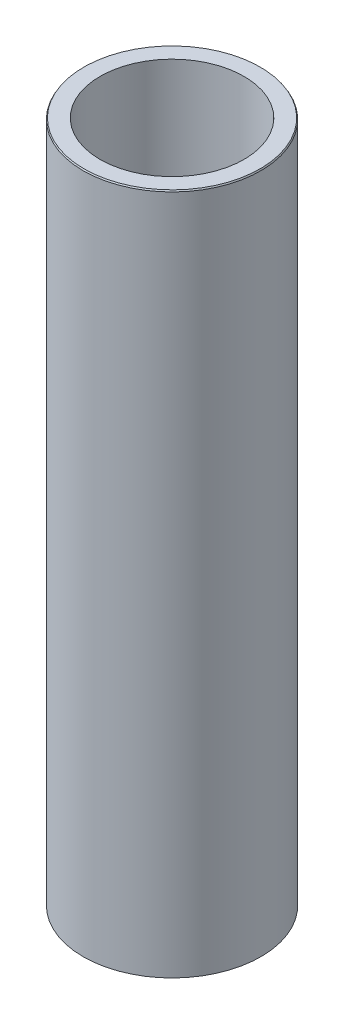
ISO-10303-21;
HEADER;
FILE_DESCRIPTION(('STEP AP214'),'2;1');
FILE_NAME('part.step','',(''),(''),'','','');
FILE_SCHEMA(('AUTOMOTIVE_DESIGN { 1 0 10303 214 1 1 1 1 }'));
ENDSEC;
DATA;
#1=APPLICATION_CONTEXT('core data for automotive mechanical design processes');
#2=APPLICATION_PROTOCOL_DEFINITION('international standard','automotive_design',2000,#1);
#3=PRODUCT_CONTEXT('',#1,'mechanical');
#4=PRODUCT('Part','Part','',(#3));
#5=PRODUCT_RELATED_PRODUCT_CATEGORY('part','',(#4));
#6=PRODUCT_DEFINITION_FORMATION('','',#4);
#7=PRODUCT_DEFINITION_CONTEXT('part definition',#1,'design');
#8=PRODUCT_DEFINITION('design','',#6,#7);
#9=PRODUCT_DEFINITION_SHAPE('','',#8);
#10=(LENGTH_UNIT() NAMED_UNIT(*) SI_UNIT(.MILLI.,.METRE.));
#11=(NAMED_UNIT(*) PLANE_ANGLE_UNIT() SI_UNIT($,.RADIAN.));
#12=(NAMED_UNIT(*) SI_UNIT($,.STERADIAN.) SOLID_ANGLE_UNIT());
#13=UNCERTAINTY_MEASURE_WITH_UNIT(LENGTH_MEASURE(1.E-05),#10,'distance_accuracy_value','');
#14=(GEOMETRIC_REPRESENTATION_CONTEXT(3) GLOBAL_UNCERTAINTY_ASSIGNED_CONTEXT((#13)) GLOBAL_UNIT_ASSIGNED_CONTEXT((#10,
#11,#12)) REPRESENTATION_CONTEXT('',''));
#15=CARTESIAN_POINT('',(0.,0.,0.));
#16=DIRECTION('',(0.,0.,1.));
#17=DIRECTION('',(1.,0.,0.));
#18=AXIS2_PLACEMENT_3D('',#15,#16,#17);
#19=CARTESIAN_POINT('',(0.,441.658176754842,0.));
#20=DIRECTION('',(0.,-1.,0.));
#21=DIRECTION('',(0.,0.,-1.));
#22=AXIS2_PLACEMENT_3D('',#19,#20,#21);
#23=CYLINDRICAL_SURFACE('',#22,57.5);
#24=CARTESIAN_POINT('',(0.,440.819406120224,0.));
#25=DIRECTION('',(0.,1.,0.));
#26=DIRECTION('',(0.,0.,1.));
#27=AXIS2_PLACEMENT_3D('',#24,#25,#26);
#28=CIRCLE('',#27,57.5);
#29=CARTESIAN_POINT('',(0.,440.819406120224,57.5));
#30=VERTEX_POINT('',#29);
#31=EDGE_CURVE('E50',#30,#30,#28,.F.);
#32=ORIENTED_EDGE('',*,*,#31,.T.);
#33=EDGE_LOOP('',(#32));
#34=FACE_BOUND('',#33,.T.);
#35=CARTESIAN_POINT('',(0.,0.484264451685201,0.));
#36=DIRECTION('',(0.,1.,0.));
#37=DIRECTION('',(0.,0.,1.));
#38=AXIS2_PLACEMENT_3D('',#35,#36,#37);
#39=CIRCLE('',#38,57.5);
#40=CARTESIAN_POINT('',(0.,0.484264451685201,57.5));
#41=VERTEX_POINT('',#40);
#42=EDGE_CURVE('E51',#41,#41,#39,.T.);
#43=ORIENTED_EDGE('',*,*,#42,.T.);
#44=EDGE_LOOP('',(#43));
#45=FACE_BOUND('',#44,.T.);
#46=ADVANCED_FACE('F39',(#34,#45),#23,.T.);
#47=CARTESIAN_POINT('',(0.,441.658176754842,0.));
#48=DIRECTION('',(0.,1.,0.));
#49=DIRECTION('',(0.,0.,1.));
#50=AXIS2_PLACEMENT_3D('',#47,#48,#49);
#51=PLANE('',#50);
#52=CARTESIAN_POINT('',(0.,441.658176754842,0.));
#53=DIRECTION('',(0.,1.,0.));
#54=DIRECTION('',(0.,0.,1.));
#55=AXIS2_PLACEMENT_3D('',#52,#53,#54);
#56=CIRCLE('',#55,57.0157355483148);
#57=CARTESIAN_POINT('',(0.,441.658176754842,57.0157355483148));
#58=VERTEX_POINT('',#57);
#59=EDGE_CURVE('E54',#58,#58,#56,.T.);
#60=ORIENTED_EDGE('',*,*,#59,.T.);
#61=EDGE_LOOP('',(#60));
#62=FACE_BOUND('',#61,.T.);
#63=CARTESIAN_POINT('',(0.,441.658176754842,0.));
#64=DIRECTION('',(0.,1.,0.));
#65=DIRECTION('',(0.,0.,1.));
#66=AXIS2_PLACEMENT_3D('',#63,#64,#65);
#67=CIRCLE('',#66,46.5658128041425);
#68=CARTESIAN_POINT('',(0.,441.658176754842,46.5658128041425));
#69=VERTEX_POINT('',#68);
#70=EDGE_CURVE('E58',#69,#69,#67,.T.);
#71=ORIENTED_EDGE('',*,*,#70,.F.);
#72=EDGE_LOOP('',(#71));
#73=FACE_BOUND('',#72,.T.);
#74=ADVANCED_FACE('F69',(#62,#73),#51,.T.);
#75=CARTESIAN_POINT('',(0.,0.,0.));
#76=DIRECTION('',(0.,1.,0.));
#77=DIRECTION('',(0.,0.,1.));
#78=AXIS2_PLACEMENT_3D('',#75,#76,#77);
#79=PLANE('',#78);
#80=CARTESIAN_POINT('',(0.,0.,0.));
#81=DIRECTION('',(0.,1.,0.));
#82=DIRECTION('',(0.,0.,1.));
#83=AXIS2_PLACEMENT_3D('',#80,#81,#82);
#84=CIRCLE('',#83,56.6612293653818);
#85=CARTESIAN_POINT('',(0.,0.,56.6612293653818));
#86=VERTEX_POINT('',#85);
#87=EDGE_CURVE('E10',#86,#86,#84,.F.);
#88=ORIENTED_EDGE('',*,*,#87,.T.);
#89=EDGE_LOOP('',(#88));
#90=FACE_BOUND('',#89,.T.);
#91=CARTESIAN_POINT('',(0.,0.,0.));
#92=DIRECTION('',(0.,1.,0.));
#93=DIRECTION('',(0.,0.,1.));
#94=AXIS2_PLACEMENT_3D('',#91,#92,#93);
#95=CIRCLE('',#94,46.5658128041425);
#96=CARTESIAN_POINT('',(0.,0.,46.5658128041425));
#97=VERTEX_POINT('',#96);
#98=EDGE_CURVE('E63',#97,#97,#95,.T.);
#99=ORIENTED_EDGE('',*,*,#98,.T.);
#100=EDGE_LOOP('',(#99));
#101=FACE_BOUND('',#100,.T.);
#102=ADVANCED_FACE('F75',(#90,#101),#79,.F.);
#103=CARTESIAN_POINT('',(0.,441.658176754842,0.));
#104=DIRECTION('',(0.,-1.,0.));
#105=DIRECTION('',(0.,0.,-1.));
#106=AXIS2_PLACEMENT_3D('',#103,#104,#105);
#107=CYLINDRICAL_SURFACE('',#106,46.5658128041425);
#108=ORIENTED_EDGE('',*,*,#70,.T.);
#109=EDGE_LOOP('',(#108));
#110=FACE_BOUND('',#109,.T.);
#111=ORIENTED_EDGE('',*,*,#98,.F.);
#112=EDGE_LOOP('',(#111));
#113=FACE_BOUND('',#112,.T.);
#114=ADVANCED_FACE('F70',(#110,#113),#107,.F.);
#115=CARTESIAN_POINT('',(0.,441.658176754842,0.));
#116=DIRECTION('',(0.,-1.,0.));
#117=DIRECTION('',(0.,0.,-1.));
#118=AXIS2_PLACEMENT_3D('',#115,#116,#117);
#119=CONICAL_SURFACE('',#118,57.0157355483148,0.523598775598371);
#120=ORIENTED_EDGE('',*,*,#31,.F.);
#121=EDGE_LOOP('',(#120));
#122=FACE_BOUND('',#121,.T.);
#123=ORIENTED_EDGE('',*,*,#59,.F.);
#124=EDGE_LOOP('',(#123));
#125=FACE_BOUND('',#124,.T.);
#126=ADVANCED_FACE('F81',(#122,#125),#119,.T.);
#127=CARTESIAN_POINT('',(0.,0.484264451685201,0.));
#128=DIRECTION('',(0.,1.,0.));
#129=DIRECTION('',(0.,0.,1.));
#130=AXIS2_PLACEMENT_3D('',#127,#128,#129);
#131=CONICAL_SURFACE('',#130,57.5,1.0471975511966);
#132=ORIENTED_EDGE('',*,*,#87,.F.);
#133=EDGE_LOOP('',(#132));
#134=FACE_BOUND('',#133,.T.);
#135=ORIENTED_EDGE('',*,*,#42,.F.);
#136=EDGE_LOOP('',(#135));
#137=FACE_BOUND('',#136,.T.);
#138=ADVANCED_FACE('F45',(#134,#137),#131,.T.);
#139=CLOSED_SHELL('',(#46,#74,#102,#114,#126,#138));
#140=MANIFOLD_SOLID_BREP('B2',#139);
#141=ADVANCED_BREP_SHAPE_REPRESENTATION('',(#18,#140),#14);
#142=SHAPE_DEFINITION_REPRESENTATION(#9,#141);
ENDSEC;
END-ISO-10303-21;
